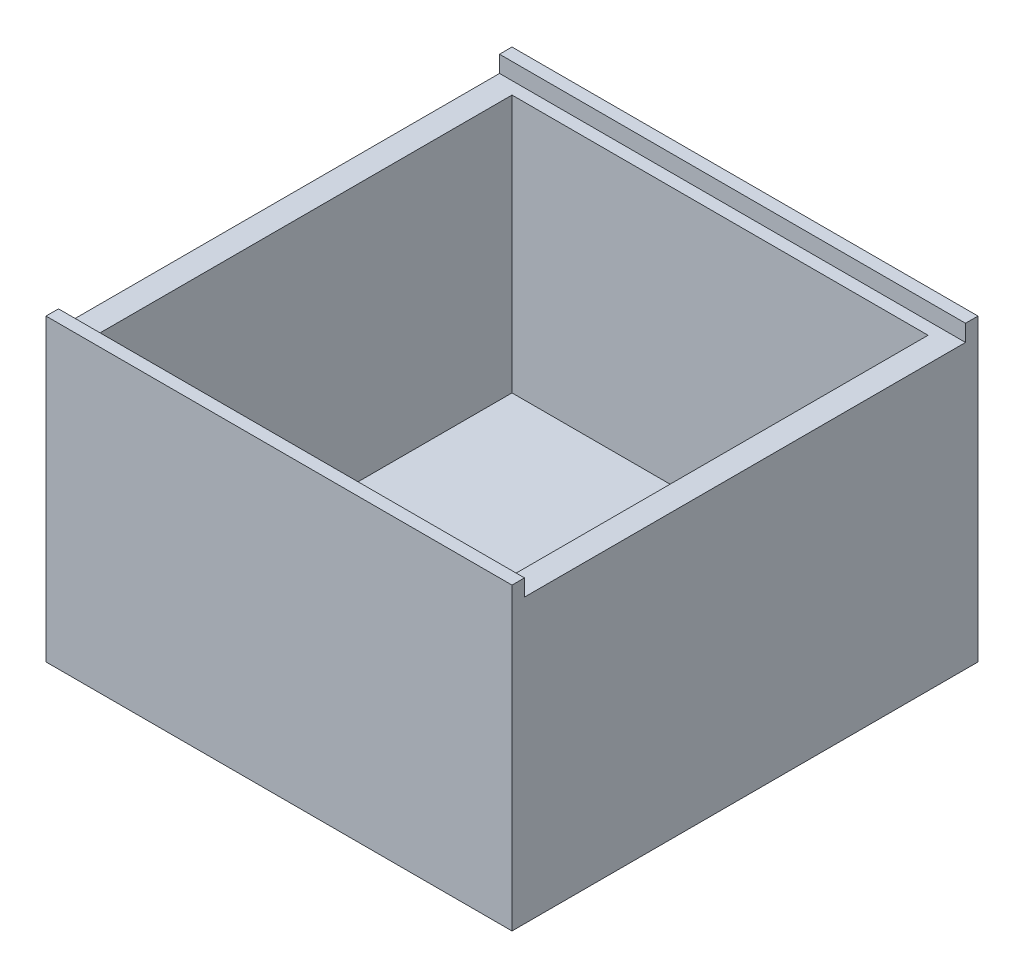
ISO-10303-21;
HEADER;
FILE_DESCRIPTION(('STEP AP214'),'2;1');
FILE_NAME('part.step','',(''),(''),'','','');
FILE_SCHEMA(('AUTOMOTIVE_DESIGN { 1 0 10303 214 1 1 1 1 }'));
ENDSEC;
DATA;
#1=APPLICATION_CONTEXT('core data for automotive mechanical design processes');
#2=APPLICATION_PROTOCOL_DEFINITION('international standard','automotive_design',2000,#1);
#3=PRODUCT_CONTEXT('',#1,'mechanical');
#4=PRODUCT('Part','Part','',(#3));
#5=PRODUCT_RELATED_PRODUCT_CATEGORY('part','',(#4));
#6=PRODUCT_DEFINITION_FORMATION('','',#4);
#7=PRODUCT_DEFINITION_CONTEXT('part definition',#1,'design');
#8=PRODUCT_DEFINITION('design','',#6,#7);
#9=PRODUCT_DEFINITION_SHAPE('','',#8);
#10=(LENGTH_UNIT() NAMED_UNIT(*) SI_UNIT(.MILLI.,.METRE.));
#11=(NAMED_UNIT(*) PLANE_ANGLE_UNIT() SI_UNIT($,.RADIAN.));
#12=(NAMED_UNIT(*) SI_UNIT($,.STERADIAN.) SOLID_ANGLE_UNIT());
#13=UNCERTAINTY_MEASURE_WITH_UNIT(LENGTH_MEASURE(1.E-05),#10,'distance_accuracy_value','');
#14=(GEOMETRIC_REPRESENTATION_CONTEXT(3) GLOBAL_UNCERTAINTY_ASSIGNED_CONTEXT((#13)) GLOBAL_UNIT_ASSIGNED_CONTEXT((#10,
#11,#12)) REPRESENTATION_CONTEXT('',''));
#15=CARTESIAN_POINT('',(0.,0.,0.));
#16=DIRECTION('',(0.,0.,1.));
#17=DIRECTION('',(1.,0.,0.));
#18=AXIS2_PLACEMENT_3D('',#15,#16,#17);
#19=CARTESIAN_POINT('',(0.,18.,0.));
#20=DIRECTION('',(0.,1.,0.));
#21=DIRECTION('',(0.,0.,1.));
#22=AXIS2_PLACEMENT_3D('',#19,#20,#21);
#23=PLANE('',#22);
#24=DIRECTION('',(-1.,0.,0.));
#25=VECTOR('',#24,1.);
#26=CARTESIAN_POINT('',(14.,18.,13.25));
#27=LINE('',#26,#25);
#28=CARTESIAN_POINT('',(14.,18.,13.25));
#29=VERTEX_POINT('',#28);
#30=CARTESIAN_POINT('',(-14.,18.,13.25));
#31=VERTEX_POINT('',#30);
#32=EDGE_CURVE('E149',#29,#31,#27,.T.);
#33=ORIENTED_EDGE('',*,*,#32,.T.);
#34=DIRECTION('',(0.,0.,1.));
#35=VECTOR('',#34,1.);
#36=CARTESIAN_POINT('',(-14.,18.,-14.));
#37=LINE('',#36,#35);
#38=CARTESIAN_POINT('',(-14.,18.,14.));
#39=VERTEX_POINT('',#38);
#40=EDGE_CURVE('E184',#31,#39,#37,.T.);
#41=ORIENTED_EDGE('',*,*,#40,.T.);
#42=DIRECTION('',(1.,0.,0.));
#43=VECTOR('',#42,1.);
#44=CARTESIAN_POINT('',(-14.,18.,14.));
#45=LINE('',#44,#43);
#46=CARTESIAN_POINT('',(14.,18.,14.));
#47=VERTEX_POINT('',#46);
#48=EDGE_CURVE('E183',#39,#47,#45,.T.);
#49=ORIENTED_EDGE('',*,*,#48,.T.);
#50=DIRECTION('',(0.,0.,-1.));
#51=VECTOR('',#50,1.);
#52=CARTESIAN_POINT('',(14.,18.,-14.));
#53=LINE('',#52,#51);
#54=EDGE_CURVE('E186',#47,#29,#53,.T.);
#55=ORIENTED_EDGE('',*,*,#54,.T.);
#56=EDGE_LOOP('',(#33,#41,#49,#55));
#57=FACE_BOUND('',#56,.T.);
#58=ADVANCED_FACE('F32',(#57),#23,.T.);
#59=CARTESIAN_POINT('',(-14.,18.,-14.));
#60=DIRECTION('',(1.,0.,0.));
#61=DIRECTION('',(0.,0.,-1.));
#62=AXIS2_PLACEMENT_3D('',#59,#60,#61);
#63=PLANE('',#62);
#64=ORIENTED_EDGE('',*,*,#40,.F.);
#65=DIRECTION('',(0.,1.,0.));
#66=VECTOR('',#65,1.);
#67=CARTESIAN_POINT('',(-14.,17.,13.25));
#68=LINE('',#67,#66);
#69=CARTESIAN_POINT('',(-14.,17.,13.25));
#70=VERTEX_POINT('',#69);
#71=EDGE_CURVE('E141',#70,#31,#68,.T.);
#72=ORIENTED_EDGE('',*,*,#71,.F.);
#73=DIRECTION('',(0.,0.,1.));
#74=VECTOR('',#73,1.);
#75=CARTESIAN_POINT('',(-14.,17.,-13.25));
#76=LINE('',#75,#74);
#77=CARTESIAN_POINT('',(-14.,17.,-13.25));
#78=VERTEX_POINT('',#77);
#79=EDGE_CURVE('E143',#78,#70,#76,.T.);
#80=ORIENTED_EDGE('',*,*,#79,.F.);
#81=DIRECTION('',(0.,-1.,0.));
#82=VECTOR('',#81,1.);
#83=CARTESIAN_POINT('',(-14.,18.,-13.25));
#84=LINE('',#83,#82);
#85=CARTESIAN_POINT('',(-14.,18.,-13.25));
#86=VERTEX_POINT('',#85);
#87=EDGE_CURVE('E122',#86,#78,#84,.T.);
#88=ORIENTED_EDGE('',*,*,#87,.F.);
#89=CARTESIAN_POINT('',(-14.,18.,-14.));
#90=VERTEX_POINT('',#89);
#91=EDGE_CURVE('E180',#90,#86,#37,.T.);
#92=ORIENTED_EDGE('',*,*,#91,.F.);
#93=DIRECTION('',(0.,-1.,0.));
#94=VECTOR('',#93,1.);
#95=CARTESIAN_POINT('',(-14.,18.,-14.));
#96=LINE('',#95,#94);
#97=CARTESIAN_POINT('',(-14.,0.,-14.));
#98=VERTEX_POINT('',#97);
#99=EDGE_CURVE('E191',#90,#98,#96,.T.);
#100=ORIENTED_EDGE('',*,*,#99,.T.);
#101=DIRECTION('',(0.,0.,1.));
#102=VECTOR('',#101,1.);
#103=CARTESIAN_POINT('',(-14.,0.,-14.));
#104=LINE('',#103,#102);
#105=CARTESIAN_POINT('',(-14.,0.,14.));
#106=VERTEX_POINT('',#105);
#107=EDGE_CURVE('E165',#98,#106,#104,.T.);
#108=ORIENTED_EDGE('',*,*,#107,.T.);
#109=DIRECTION('',(0.,-1.,0.));
#110=VECTOR('',#109,1.);
#111=CARTESIAN_POINT('',(-14.,18.,14.));
#112=LINE('',#111,#110);
#113=EDGE_CURVE('E40',#39,#106,#112,.T.);
#114=ORIENTED_EDGE('',*,*,#113,.F.);
#115=EDGE_LOOP('',(#64,#72,#80,#88,#92,#100,#108,#114));
#116=FACE_BOUND('',#115,.T.);
#117=ADVANCED_FACE('F34',(#116),#63,.F.);
#118=CARTESIAN_POINT('',(-14.,18.,14.));
#119=DIRECTION('',(0.,0.,-1.));
#120=DIRECTION('',(-1.,0.,0.));
#121=AXIS2_PLACEMENT_3D('',#118,#119,#120);
#122=PLANE('',#121);
#123=DIRECTION('',(1.,0.,0.));
#124=VECTOR('',#123,1.);
#125=CARTESIAN_POINT('',(-14.,0.,14.));
#126=LINE('',#125,#124);
#127=CARTESIAN_POINT('',(14.,0.,14.));
#128=VERTEX_POINT('',#127);
#129=EDGE_CURVE('E194',#106,#128,#126,.T.);
#130=ORIENTED_EDGE('',*,*,#129,.T.);
#131=DIRECTION('',(0.,-1.,0.));
#132=VECTOR('',#131,1.);
#133=CARTESIAN_POINT('',(14.,18.,14.));
#134=LINE('',#133,#132);
#135=EDGE_CURVE('E205',#47,#128,#134,.T.);
#136=ORIENTED_EDGE('',*,*,#135,.F.);
#137=ORIENTED_EDGE('',*,*,#48,.F.);
#138=ORIENTED_EDGE('',*,*,#113,.T.);
#139=EDGE_LOOP('',(#130,#136,#137,#138));
#140=FACE_BOUND('',#139,.T.);
#141=ADVANCED_FACE('F211',(#140),#122,.F.);
#142=CARTESIAN_POINT('',(14.,18.,-14.));
#143=DIRECTION('',(-1.,0.,0.));
#144=DIRECTION('',(0.,0.,1.));
#145=AXIS2_PLACEMENT_3D('',#142,#143,#144);
#146=PLANE('',#145);
#147=DIRECTION('',(0.,0.,1.));
#148=VECTOR('',#147,1.);
#149=CARTESIAN_POINT('',(14.,17.,-13.25));
#150=LINE('',#149,#148);
#151=CARTESIAN_POINT('',(14.,17.,-13.25));
#152=VERTEX_POINT('',#151);
#153=CARTESIAN_POINT('',(14.,17.,13.25));
#154=VERTEX_POINT('',#153);
#155=EDGE_CURVE('E130',#152,#154,#150,.T.);
#156=ORIENTED_EDGE('',*,*,#155,.T.);
#157=DIRECTION('',(0.,1.,0.));
#158=VECTOR('',#157,1.);
#159=CARTESIAN_POINT('',(14.,17.,13.25));
#160=LINE('',#159,#158);
#161=EDGE_CURVE('E135',#154,#29,#160,.T.);
#162=ORIENTED_EDGE('',*,*,#161,.T.);
#163=ORIENTED_EDGE('',*,*,#54,.F.);
#164=ORIENTED_EDGE('',*,*,#135,.T.);
#165=DIRECTION('',(0.,0.,-1.));
#166=VECTOR('',#165,1.);
#167=CARTESIAN_POINT('',(14.,0.,-14.));
#168=LINE('',#167,#166);
#169=CARTESIAN_POINT('',(14.,0.,-14.));
#170=VERTEX_POINT('',#169);
#171=EDGE_CURVE('E196',#128,#170,#168,.T.);
#172=ORIENTED_EDGE('',*,*,#171,.T.);
#173=DIRECTION('',(0.,-1.,0.));
#174=VECTOR('',#173,1.);
#175=CARTESIAN_POINT('',(14.,18.,-14.));
#176=LINE('',#175,#174);
#177=CARTESIAN_POINT('',(14.,18.,-14.));
#178=VERTEX_POINT('',#177);
#179=EDGE_CURVE('E202',#178,#170,#176,.T.);
#180=ORIENTED_EDGE('',*,*,#179,.F.);
#181=CARTESIAN_POINT('',(14.,18.,-13.25));
#182=VERTEX_POINT('',#181);
#183=EDGE_CURVE('E140',#182,#178,#53,.T.);
#184=ORIENTED_EDGE('',*,*,#183,.F.);
#185=DIRECTION('',(0.,-1.,0.));
#186=VECTOR('',#185,1.);
#187=CARTESIAN_POINT('',(14.,18.,-13.25));
#188=LINE('',#187,#186);
#189=EDGE_CURVE('E47',#182,#152,#188,.T.);
#190=ORIENTED_EDGE('',*,*,#189,.T.);
#191=EDGE_LOOP('',(#156,#162,#163,#164,#172,#180,#184,#190));
#192=FACE_BOUND('',#191,.T.);
#193=ADVANCED_FACE('F138',(#192),#146,.F.);
#194=CARTESIAN_POINT('',(-14.,18.,-14.));
#195=DIRECTION('',(0.,0.,1.));
#196=DIRECTION('',(1.,0.,0.));
#197=AXIS2_PLACEMENT_3D('',#194,#195,#196);
#198=PLANE('',#197);
#199=DIRECTION('',(-1.,0.,0.));
#200=VECTOR('',#199,1.);
#201=CARTESIAN_POINT('',(-14.,0.,-14.));
#202=LINE('',#201,#200);
#203=EDGE_CURVE('E198',#170,#98,#202,.T.);
#204=ORIENTED_EDGE('',*,*,#203,.T.);
#205=ORIENTED_EDGE('',*,*,#99,.F.);
#206=DIRECTION('',(-1.,0.,0.));
#207=VECTOR('',#206,1.);
#208=CARTESIAN_POINT('',(-14.,18.,-14.));
#209=LINE('',#208,#207);
#210=EDGE_CURVE('E189',#178,#90,#209,.T.);
#211=ORIENTED_EDGE('',*,*,#210,.F.);
#212=ORIENTED_EDGE('',*,*,#179,.T.);
#213=EDGE_LOOP('',(#204,#205,#211,#212));
#214=FACE_BOUND('',#213,.T.);
#215=ADVANCED_FACE('F225',(#214),#198,.F.);
#216=DIRECTION('',(-1.,0.,0.));
#217=VECTOR('',#216,1.);
#218=CARTESIAN_POINT('',(14.,18.,-13.25));
#219=LINE('',#218,#217);
#220=EDGE_CURVE('E127',#182,#86,#219,.T.);
#221=ORIENTED_EDGE('',*,*,#220,.F.);
#222=ORIENTED_EDGE('',*,*,#183,.T.);
#223=ORIENTED_EDGE('',*,*,#210,.T.);
#224=ORIENTED_EDGE('',*,*,#91,.T.);
#225=EDGE_LOOP('',(#221,#222,#223,#224));
#226=FACE_BOUND('',#225,.T.);
#227=ADVANCED_FACE('F227',(#226),#23,.T.);
#228=CARTESIAN_POINT('',(0.,0.,0.));
#229=DIRECTION('',(0.,1.,0.));
#230=DIRECTION('',(0.,0.,1.));
#231=AXIS2_PLACEMENT_3D('',#228,#229,#230);
#232=PLANE('',#231);
#233=ORIENTED_EDGE('',*,*,#107,.F.);
#234=ORIENTED_EDGE('',*,*,#203,.F.);
#235=ORIENTED_EDGE('',*,*,#171,.F.);
#236=ORIENTED_EDGE('',*,*,#129,.F.);
#237=EDGE_LOOP('',(#233,#234,#235,#236));
#238=FACE_BOUND('',#237,.T.);
#239=ADVANCED_FACE('F220',(#238),#232,.F.);
#240=CARTESIAN_POINT('',(14.,17.,13.25));
#241=DIRECTION('',(0.,0.,1.));
#242=DIRECTION('',(1.,0.,0.));
#243=AXIS2_PLACEMENT_3D('',#240,#241,#242);
#244=PLANE('',#243);
#245=ORIENTED_EDGE('',*,*,#71,.T.);
#246=ORIENTED_EDGE('',*,*,#32,.F.);
#247=ORIENTED_EDGE('',*,*,#161,.F.);
#248=DIRECTION('',(-1.,0.,0.));
#249=VECTOR('',#248,1.);
#250=CARTESIAN_POINT('',(14.,17.,13.25));
#251=LINE('',#250,#249);
#252=EDGE_CURVE('E126',#154,#70,#251,.T.);
#253=ORIENTED_EDGE('',*,*,#252,.T.);
#254=EDGE_LOOP('',(#245,#246,#247,#253));
#255=FACE_BOUND('',#254,.T.);
#256=ADVANCED_FACE('F230',(#255),#244,.F.);
#257=CARTESIAN_POINT('',(14.,17.,-13.25));
#258=DIRECTION('',(0.,-1.,0.));
#259=DIRECTION('',(0.,0.,-1.));
#260=AXIS2_PLACEMENT_3D('',#257,#258,#259);
#261=PLANE('',#260);
#262=DIRECTION('',(0.,0.,-1.));
#263=VECTOR('',#262,1.);
#264=CARTESIAN_POINT('',(-12.5,17.,-14.));
#265=LINE('',#264,#263);
#266=CARTESIAN_POINT('',(-12.5,17.,12.5));
#267=VERTEX_POINT('',#266);
#268=CARTESIAN_POINT('',(-12.5,17.,-12.5));
#269=VERTEX_POINT('',#268);
#270=EDGE_CURVE('E54',#267,#269,#265,.T.);
#271=ORIENTED_EDGE('',*,*,#270,.T.);
#272=DIRECTION('',(1.,0.,0.));
#273=VECTOR('',#272,1.);
#274=CARTESIAN_POINT('',(-14.,17.,-12.5));
#275=LINE('',#274,#273);
#276=CARTESIAN_POINT('',(12.5,17.,-12.5));
#277=VERTEX_POINT('',#276);
#278=EDGE_CURVE('E11',#269,#277,#275,.T.);
#279=ORIENTED_EDGE('',*,*,#278,.T.);
#280=DIRECTION('',(0.,0.,1.));
#281=VECTOR('',#280,1.);
#282=CARTESIAN_POINT('',(12.5,17.,-14.));
#283=LINE('',#282,#281);
#284=CARTESIAN_POINT('',(12.5,17.,12.5));
#285=VERTEX_POINT('',#284);
#286=EDGE_CURVE('E152',#277,#285,#283,.T.);
#287=ORIENTED_EDGE('',*,*,#286,.T.);
#288=DIRECTION('',(-1.,0.,0.));
#289=VECTOR('',#288,1.);
#290=CARTESIAN_POINT('',(-14.,17.,12.5));
#291=LINE('',#290,#289);
#292=EDGE_CURVE('E156',#285,#267,#291,.T.);
#293=ORIENTED_EDGE('',*,*,#292,.T.);
#294=EDGE_LOOP('',(#271,#279,#287,#293));
#295=FACE_BOUND('',#294,.T.);
#296=ORIENTED_EDGE('',*,*,#79,.T.);
#297=ORIENTED_EDGE('',*,*,#252,.F.);
#298=ORIENTED_EDGE('',*,*,#155,.F.);
#299=DIRECTION('',(-1.,0.,0.));
#300=VECTOR('',#299,1.);
#301=CARTESIAN_POINT('',(14.,17.,-13.25));
#302=LINE('',#301,#300);
#303=EDGE_CURVE('E118',#152,#78,#302,.T.);
#304=ORIENTED_EDGE('',*,*,#303,.T.);
#305=EDGE_LOOP('',(#296,#297,#298,#304));
#306=FACE_BOUND('',#305,.T.);
#307=ADVANCED_FACE('F131',(#295,#306),#261,.F.);
#308=CARTESIAN_POINT('',(14.,18.,-13.25));
#309=DIRECTION('',(0.,0.,-1.));
#310=DIRECTION('',(-1.,0.,0.));
#311=AXIS2_PLACEMENT_3D('',#308,#309,#310);
#312=PLANE('',#311);
#313=ORIENTED_EDGE('',*,*,#87,.T.);
#314=ORIENTED_EDGE('',*,*,#303,.F.);
#315=ORIENTED_EDGE('',*,*,#189,.F.);
#316=ORIENTED_EDGE('',*,*,#220,.T.);
#317=EDGE_LOOP('',(#313,#314,#315,#316));
#318=FACE_BOUND('',#317,.T.);
#319=ADVANCED_FACE('F120',(#318),#312,.F.);
#320=CARTESIAN_POINT('',(0.,1.5,0.));
#321=DIRECTION('',(0.,1.,0.));
#322=DIRECTION('',(0.,0.,1.));
#323=AXIS2_PLACEMENT_3D('',#320,#321,#322);
#324=PLANE('',#323);
#325=DIRECTION('',(0.,0.,1.));
#326=VECTOR('',#325,1.);
#327=CARTESIAN_POINT('',(-12.5,1.5,-14.));
#328=LINE('',#327,#326);
#329=CARTESIAN_POINT('',(-12.5,1.5,-12.5));
#330=VERTEX_POINT('',#329);
#331=CARTESIAN_POINT('',(-12.5,1.5,12.5));
#332=VERTEX_POINT('',#331);
#333=EDGE_CURVE('E159',#330,#332,#328,.T.);
#334=ORIENTED_EDGE('',*,*,#333,.T.);
#335=DIRECTION('',(1.,0.,0.));
#336=VECTOR('',#335,1.);
#337=CARTESIAN_POINT('',(-14.,1.5,12.5));
#338=LINE('',#337,#336);
#339=CARTESIAN_POINT('',(12.5,1.5,12.5));
#340=VERTEX_POINT('',#339);
#341=EDGE_CURVE('E162',#332,#340,#338,.T.);
#342=ORIENTED_EDGE('',*,*,#341,.T.);
#343=DIRECTION('',(0.,0.,-1.));
#344=VECTOR('',#343,1.);
#345=CARTESIAN_POINT('',(12.5,1.5,-14.));
#346=LINE('',#345,#344);
#347=CARTESIAN_POINT('',(12.5,1.5,-12.5));
#348=VERTEX_POINT('',#347);
#349=EDGE_CURVE('E173',#340,#348,#346,.T.);
#350=ORIENTED_EDGE('',*,*,#349,.T.);
#351=DIRECTION('',(-1.,0.,0.));
#352=VECTOR('',#351,1.);
#353=CARTESIAN_POINT('',(-14.,1.5,-12.5));
#354=LINE('',#353,#352);
#355=EDGE_CURVE('E170',#348,#330,#354,.T.);
#356=ORIENTED_EDGE('',*,*,#355,.T.);
#357=EDGE_LOOP('',(#334,#342,#350,#356));
#358=FACE_BOUND('',#357,.T.);
#359=ADVANCED_FACE('F292',(#358),#324,.T.);
#360=CARTESIAN_POINT('',(-14.,18.,-12.5));
#361=DIRECTION('',(0.,0.,1.));
#362=DIRECTION('',(1.,0.,0.));
#363=AXIS2_PLACEMENT_3D('',#360,#361,#362);
#364=PLANE('',#363);
#365=ORIENTED_EDGE('',*,*,#278,.F.);
#366=DIRECTION('',(0.,-1.,0.));
#367=VECTOR('',#366,1.);
#368=CARTESIAN_POINT('',(-12.5,18.,-12.5));
#369=LINE('',#368,#367);
#370=EDGE_CURVE('E167',#269,#330,#369,.T.);
#371=ORIENTED_EDGE('',*,*,#370,.T.);
#372=ORIENTED_EDGE('',*,*,#355,.F.);
#373=DIRECTION('',(0.,-1.,0.));
#374=VECTOR('',#373,1.);
#375=CARTESIAN_POINT('',(12.5,18.,-12.5));
#376=LINE('',#375,#374);
#377=EDGE_CURVE('E169',#277,#348,#376,.T.);
#378=ORIENTED_EDGE('',*,*,#377,.F.);
#379=EDGE_LOOP('',(#365,#371,#372,#378));
#380=FACE_BOUND('',#379,.T.);
#381=ADVANCED_FACE('F298',(#380),#364,.T.);
#382=CARTESIAN_POINT('',(12.5,18.,-14.));
#383=DIRECTION('',(-1.,0.,0.));
#384=DIRECTION('',(0.,0.,1.));
#385=AXIS2_PLACEMENT_3D('',#382,#383,#384);
#386=PLANE('',#385);
#387=ORIENTED_EDGE('',*,*,#286,.F.);
#388=ORIENTED_EDGE('',*,*,#377,.T.);
#389=ORIENTED_EDGE('',*,*,#349,.F.);
#390=DIRECTION('',(0.,-1.,0.));
#391=VECTOR('',#390,1.);
#392=CARTESIAN_POINT('',(12.5,18.,12.5));
#393=LINE('',#392,#391);
#394=EDGE_CURVE('E166',#285,#340,#393,.T.);
#395=ORIENTED_EDGE('',*,*,#394,.F.);
#396=EDGE_LOOP('',(#387,#388,#389,#395));
#397=FACE_BOUND('',#396,.T.);
#398=ADVANCED_FACE('F303',(#397),#386,.T.);
#399=CARTESIAN_POINT('',(-14.,18.,12.5));
#400=DIRECTION('',(0.,0.,-1.));
#401=DIRECTION('',(-1.,0.,0.));
#402=AXIS2_PLACEMENT_3D('',#399,#400,#401);
#403=PLANE('',#402);
#404=ORIENTED_EDGE('',*,*,#292,.F.);
#405=ORIENTED_EDGE('',*,*,#394,.T.);
#406=ORIENTED_EDGE('',*,*,#341,.F.);
#407=DIRECTION('',(0.,-1.,0.));
#408=VECTOR('',#407,1.);
#409=CARTESIAN_POINT('',(-12.5,18.,12.5));
#410=LINE('',#409,#408);
#411=EDGE_CURVE('E163',#267,#332,#410,.T.);
#412=ORIENTED_EDGE('',*,*,#411,.F.);
#413=EDGE_LOOP('',(#404,#405,#406,#412));
#414=FACE_BOUND('',#413,.T.);
#415=ADVANCED_FACE('F314',(#414),#403,.T.);
#416=CARTESIAN_POINT('',(-12.5,18.,-14.));
#417=DIRECTION('',(1.,0.,0.));
#418=DIRECTION('',(0.,0.,-1.));
#419=AXIS2_PLACEMENT_3D('',#416,#417,#418);
#420=PLANE('',#419);
#421=ORIENTED_EDGE('',*,*,#270,.F.);
#422=ORIENTED_EDGE('',*,*,#411,.T.);
#423=ORIENTED_EDGE('',*,*,#333,.F.);
#424=ORIENTED_EDGE('',*,*,#370,.F.);
#425=EDGE_LOOP('',(#421,#422,#423,#424));
#426=FACE_BOUND('',#425,.T.);
#427=ADVANCED_FACE('F324',(#426),#420,.T.);
#428=CLOSED_SHELL('',(#58,#117,#141,#193,#215,#227,#239,#256,#307,#319,#359,#381,#398,#415,#427));
#429=MANIFOLD_SOLID_BREP('B2',#428);
#430=ADVANCED_BREP_SHAPE_REPRESENTATION('',(#18,#429),#14);
#431=SHAPE_DEFINITION_REPRESENTATION(#9,#430);
ENDSEC;
END-ISO-10303-21;
